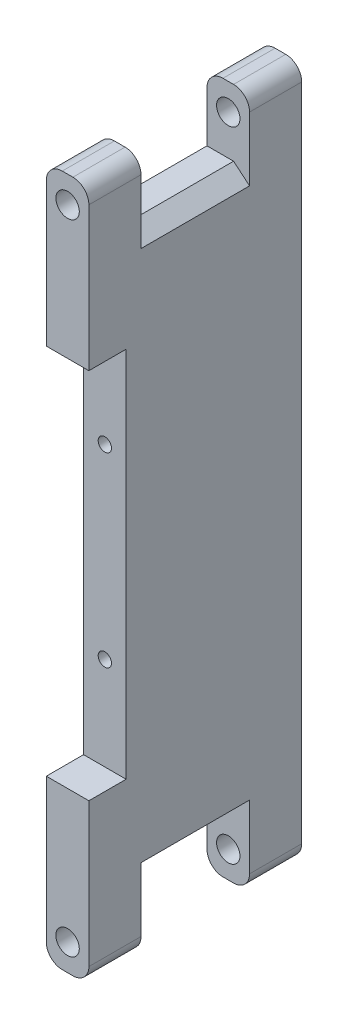
ISO-10303-21;
HEADER;
FILE_DESCRIPTION(('STEP AP214'),'2;1');
FILE_NAME('part.step','',(''),(''),'','','');
FILE_SCHEMA(('AUTOMOTIVE_DESIGN { 1 0 10303 214 1 1 1 1 }'));
ENDSEC;
DATA;
#1=APPLICATION_CONTEXT('core data for automotive mechanical design processes');
#2=APPLICATION_PROTOCOL_DEFINITION('international standard','automotive_design',2000,#1);
#3=PRODUCT_CONTEXT('',#1,'mechanical');
#4=PRODUCT('Part','Part','',(#3));
#5=PRODUCT_RELATED_PRODUCT_CATEGORY('part','',(#4));
#6=PRODUCT_DEFINITION_FORMATION('','',#4);
#7=PRODUCT_DEFINITION_CONTEXT('part definition',#1,'design');
#8=PRODUCT_DEFINITION('design','',#6,#7);
#9=PRODUCT_DEFINITION_SHAPE('','',#8);
#10=(LENGTH_UNIT() NAMED_UNIT(*) SI_UNIT(.MILLI.,.METRE.));
#11=(NAMED_UNIT(*) PLANE_ANGLE_UNIT() SI_UNIT($,.RADIAN.));
#12=(NAMED_UNIT(*) SI_UNIT($,.STERADIAN.) SOLID_ANGLE_UNIT());
#13=UNCERTAINTY_MEASURE_WITH_UNIT(LENGTH_MEASURE(1.E-05),#10,'distance_accuracy_value','');
#14=(GEOMETRIC_REPRESENTATION_CONTEXT(3) GLOBAL_UNCERTAINTY_ASSIGNED_CONTEXT((#13)) GLOBAL_UNIT_ASSIGNED_CONTEXT((#10,
#11,#12)) REPRESENTATION_CONTEXT('',''));
#15=CARTESIAN_POINT('',(0.,0.,0.));
#16=DIRECTION('',(0.,0.,1.));
#17=DIRECTION('',(1.,0.,0.));
#18=AXIS2_PLACEMENT_3D('',#15,#16,#17);
#19=CARTESIAN_POINT('',(0.,0.,0.));
#20=DIRECTION('',(0.,0.,1.));
#21=DIRECTION('',(1.,0.,0.));
#22=AXIS2_PLACEMENT_3D('',#19,#20,#21);
#23=PLANE('',#22);
#24=DIRECTION('',(1.,0.,0.));
#25=VECTOR('',#24,1.);
#26=CARTESIAN_POINT('',(0.,-35.,0.));
#27=LINE('',#26,#25);
#28=CARTESIAN_POINT('',(-4.00000000000001,-35.,0.));
#29=VERTEX_POINT('',#28);
#30=CARTESIAN_POINT('',(4.00000000000001,-35.,0.));
#31=VERTEX_POINT('',#30);
#32=EDGE_CURVE('E223',#29,#31,#27,.T.);
#33=ORIENTED_EDGE('',*,*,#32,.F.);
#34=DIRECTION('',(0.,-1.,0.));
#35=VECTOR('',#34,1.);
#36=CARTESIAN_POINT('',(-4.00000000000001,65.,0.));
#37=LINE('',#36,#35);
#38=CARTESIAN_POINT('',(-3.99999999999999,-62.,0.));
#39=VERTEX_POINT('',#38);
#40=EDGE_CURVE('E241',#29,#39,#37,.T.);
#41=ORIENTED_EDGE('',*,*,#40,.T.);
#42=CARTESIAN_POINT('',(-0.99999999999999,-62.,0.));
#43=DIRECTION('',(0.,0.,1.));
#44=DIRECTION('',(1.,0.,0.));
#45=AXIS2_PLACEMENT_3D('',#42,#43,#44);
#46=CIRCLE('',#45,3.);
#47=CARTESIAN_POINT('',(-0.99999999999999,-65.,0.));
#48=VERTEX_POINT('',#47);
#49=EDGE_CURVE('E302',#39,#48,#46,.T.);
#50=ORIENTED_EDGE('',*,*,#49,.T.);
#51=DIRECTION('',(1.,0.,0.));
#52=VECTOR('',#51,1.);
#53=CARTESIAN_POINT('',(-3.99999999999999,-65.,0.));
#54=LINE('',#53,#52);
#55=CARTESIAN_POINT('',(1.00000000000001,-65.,0.));
#56=VERTEX_POINT('',#55);
#57=EDGE_CURVE('E240',#48,#56,#54,.T.);
#58=ORIENTED_EDGE('',*,*,#57,.T.);
#59=CARTESIAN_POINT('',(1.00000000000001,-62.,0.));
#60=DIRECTION('',(0.,0.,1.));
#61=DIRECTION('',(1.,0.,0.));
#62=AXIS2_PLACEMENT_3D('',#59,#60,#61);
#63=CIRCLE('',#62,3.);
#64=CARTESIAN_POINT('',(4.00000000000001,-62.,0.));
#65=VERTEX_POINT('',#64);
#66=EDGE_CURVE('E300',#56,#65,#63,.T.);
#67=ORIENTED_EDGE('',*,*,#66,.T.);
#68=DIRECTION('',(0.,1.,0.));
#69=VECTOR('',#68,1.);
#70=CARTESIAN_POINT('',(3.99999999999999,65.,0.));
#71=LINE('',#70,#69);
#72=EDGE_CURVE('E412',#65,#31,#71,.T.);
#73=ORIENTED_EDGE('',*,*,#72,.T.);
#74=EDGE_LOOP('',(#33,#41,#50,#58,#67,#73));
#75=FACE_BOUND('',#74,.T.);
#76=CARTESIAN_POINT('',(0.,-60.,0.));
#77=DIRECTION('',(0.,0.,1.));
#78=DIRECTION('',(-1.,0.,0.));
#79=AXIS2_PLACEMENT_3D('',#76,#77,#78);
#80=CIRCLE('',#79,2.2);
#81=CARTESIAN_POINT('',(-2.2,-60.,0.));
#82=VERTEX_POINT('',#81);
#83=EDGE_CURVE('E448',#82,#82,#80,.T.);
#84=ORIENTED_EDGE('',*,*,#83,.F.);
#85=EDGE_LOOP('',(#84));
#86=FACE_BOUND('',#85,.T.);
#87=ADVANCED_FACE('F39',(#75,#86),#23,.T.);
#88=CARTESIAN_POINT('',(-3.99999999999999,-65.,-40.));
#89=DIRECTION('',(0.,-1.,0.));
#90=DIRECTION('',(0.,0.,-1.));
#91=AXIS2_PLACEMENT_3D('',#88,#89,#90);
#92=PLANE('',#91);
#93=ORIENTED_EDGE('',*,*,#57,.F.);
#94=DIRECTION('',(0.,0.,1.));
#95=VECTOR('',#94,1.);
#96=CARTESIAN_POINT('',(-0.99999999999999,-65.,-40.));
#97=LINE('',#96,#95);
#98=CARTESIAN_POINT('',(-0.99999999999999,-65.,-9.8));
#99=VERTEX_POINT('',#98);
#100=EDGE_CURVE('E307',#48,#99,#97,.F.);
#101=ORIENTED_EDGE('',*,*,#100,.T.);
#102=DIRECTION('',(-1.,0.,0.));
#103=VECTOR('',#102,1.);
#104=CARTESIAN_POINT('',(-3.99999999999999,-65.,-9.8));
#105=LINE('',#104,#103);
#106=CARTESIAN_POINT('',(1.00000000000001,-65.,-9.8));
#107=VERTEX_POINT('',#106);
#108=EDGE_CURVE('E400',#107,#99,#105,.T.);
#109=ORIENTED_EDGE('',*,*,#108,.F.);
#110=DIRECTION('',(0.,0.,1.));
#111=VECTOR('',#110,1.);
#112=CARTESIAN_POINT('',(1.00000000000001,-65.,-40.));
#113=LINE('',#112,#111);
#114=EDGE_CURVE('E304',#107,#56,#113,.T.);
#115=ORIENTED_EDGE('',*,*,#114,.T.);
#116=EDGE_LOOP('',(#93,#101,#109,#115));
#117=FACE_BOUND('',#116,.T.);
#118=ADVANCED_FACE('F513',(#117),#92,.T.);
#119=CARTESIAN_POINT('',(-4.00000000000001,65.,-40.));
#120=DIRECTION('',(0.,1.,0.));
#121=DIRECTION('',(0.,0.,1.));
#122=AXIS2_PLACEMENT_3D('',#119,#120,#121);
#123=PLANE('',#122);
#124=DIRECTION('',(-1.,0.,0.));
#125=VECTOR('',#124,1.);
#126=CARTESIAN_POINT('',(-4.00000000000001,65.,-40.));
#127=LINE('',#126,#125);
#128=CARTESIAN_POINT('',(0.999999999999995,65.,-40.));
#129=VERTEX_POINT('',#128);
#130=CARTESIAN_POINT('',(-1.00000000000001,65.,-40.));
#131=VERTEX_POINT('',#130);
#132=EDGE_CURVE('E405',#129,#131,#127,.T.);
#133=ORIENTED_EDGE('',*,*,#132,.T.);
#134=DIRECTION('',(0.,0.,1.));
#135=VECTOR('',#134,1.);
#136=CARTESIAN_POINT('',(-1.00000000000001,65.,-40.));
#137=LINE('',#136,#135);
#138=CARTESIAN_POINT('',(-1.00000000000001,65.,-30.2));
#139=VERTEX_POINT('',#138);
#140=EDGE_CURVE('E324',#131,#139,#137,.T.);
#141=ORIENTED_EDGE('',*,*,#140,.T.);
#142=DIRECTION('',(-1.,0.,0.));
#143=VECTOR('',#142,1.);
#144=CARTESIAN_POINT('',(-4.00000000000001,65.,-30.2));
#145=LINE('',#144,#143);
#146=CARTESIAN_POINT('',(0.999999999999995,65.,-30.2));
#147=VERTEX_POINT('',#146);
#148=EDGE_CURVE('E253',#147,#139,#145,.T.);
#149=ORIENTED_EDGE('',*,*,#148,.F.);
#150=DIRECTION('',(0.,0.,1.));
#151=VECTOR('',#150,1.);
#152=CARTESIAN_POINT('',(0.999999999999995,65.,-40.));
#153=LINE('',#152,#151);
#154=EDGE_CURVE('E322',#147,#129,#153,.F.);
#155=ORIENTED_EDGE('',*,*,#154,.T.);
#156=EDGE_LOOP('',(#133,#141,#149,#155));
#157=FACE_BOUND('',#156,.T.);
#158=ADVANCED_FACE('F554',(#157),#123,.T.);
#159=CARTESIAN_POINT('',(3.99999999999999,65.,-40.));
#160=DIRECTION('',(1.,0.,0.));
#161=DIRECTION('',(0.,1.,0.));
#162=AXIS2_PLACEMENT_3D('',#159,#160,#161);
#163=PLANE('',#162);
#164=DIRECTION('',(0.,-1.,0.));
#165=VECTOR('',#164,1.);
#166=CARTESIAN_POINT('',(4.00000000000001,-77.5,-9.8));
#167=LINE('',#166,#165);
#168=CARTESIAN_POINT('',(4.00000000000001,-49.9827011064681,-9.8));
#169=VERTEX_POINT('',#168);
#170=CARTESIAN_POINT('',(4.00000000000001,-62.,-9.8));
#171=VERTEX_POINT('',#170);
#172=EDGE_CURVE('E370',#169,#171,#167,.T.);
#173=ORIENTED_EDGE('',*,*,#172,.F.);
#174=DIRECTION('',(0.,0.,-1.));
#175=VECTOR('',#174,1.);
#176=CARTESIAN_POINT('',(4.00000000000001,-49.9827011064681,-30.2));
#177=LINE('',#176,#175);
#178=CARTESIAN_POINT('',(4.00000000000001,-49.9827011064681,-30.2));
#179=VERTEX_POINT('',#178);
#180=EDGE_CURVE('E347',#169,#179,#177,.T.);
#181=ORIENTED_EDGE('',*,*,#180,.T.);
#182=DIRECTION('',(0.,1.,0.));
#183=VECTOR('',#182,1.);
#184=CARTESIAN_POINT('',(4.00000000000001,-77.5,-30.2));
#185=LINE('',#184,#183);
#186=CARTESIAN_POINT('',(4.00000000000001,-62.,-30.2));
#187=VERTEX_POINT('',#186);
#188=EDGE_CURVE('E375',#187,#179,#185,.T.);
#189=ORIENTED_EDGE('',*,*,#188,.F.);
#190=DIRECTION('',(0.,0.,1.));
#191=VECTOR('',#190,1.);
#192=CARTESIAN_POINT('',(4.00000000000001,-62.,-40.));
#193=LINE('',#192,#191);
#194=CARTESIAN_POINT('',(4.00000000000001,-62.,-40.));
#195=VERTEX_POINT('',#194);
#196=EDGE_CURVE('E295',#187,#195,#193,.F.);
#197=ORIENTED_EDGE('',*,*,#196,.T.);
#198=DIRECTION('',(0.,1.,0.));
#199=VECTOR('',#198,1.);
#200=CARTESIAN_POINT('',(3.99999999999999,65.,-40.));
#201=LINE('',#200,#199);
#202=CARTESIAN_POINT('',(3.99999999999999,62.,-40.));
#203=VERTEX_POINT('',#202);
#204=EDGE_CURVE('E244',#195,#203,#201,.T.);
#205=ORIENTED_EDGE('',*,*,#204,.T.);
#206=DIRECTION('',(0.,0.,1.));
#207=VECTOR('',#206,1.);
#208=CARTESIAN_POINT('',(3.99999999999999,62.,-40.));
#209=LINE('',#208,#207);
#210=CARTESIAN_POINT('',(3.99999999999999,62.,-30.2));
#211=VERTEX_POINT('',#210);
#212=EDGE_CURVE('E290',#203,#211,#209,.T.);
#213=ORIENTED_EDGE('',*,*,#212,.T.);
#214=DIRECTION('',(0.,1.,0.));
#215=VECTOR('',#214,1.);
#216=CARTESIAN_POINT('',(3.99999999999999,77.5,-30.2));
#217=LINE('',#216,#215);
#218=CARTESIAN_POINT('',(4.,49.9827011064681,-30.2));
#219=VERTEX_POINT('',#218);
#220=EDGE_CURVE('E360',#219,#211,#217,.T.);
#221=ORIENTED_EDGE('',*,*,#220,.F.);
#222=DIRECTION('',(0.,0.,1.));
#223=VECTOR('',#222,1.);
#224=CARTESIAN_POINT('',(4.,49.9827011064681,-9.8));
#225=LINE('',#224,#223);
#226=CARTESIAN_POINT('',(4.,49.9827011064681,-9.8));
#227=VERTEX_POINT('',#226);
#228=EDGE_CURVE('E344',#219,#227,#225,.T.);
#229=ORIENTED_EDGE('',*,*,#228,.T.);
#230=DIRECTION('',(0.,-1.,0.));
#231=VECTOR('',#230,1.);
#232=CARTESIAN_POINT('',(3.99999999999999,77.5,-9.8));
#233=LINE('',#232,#231);
#234=CARTESIAN_POINT('',(3.99999999999999,62.,-9.8));
#235=VERTEX_POINT('',#234);
#236=EDGE_CURVE('E366',#235,#227,#233,.T.);
#237=ORIENTED_EDGE('',*,*,#236,.F.);
#238=DIRECTION('',(0.,0.,1.));
#239=VECTOR('',#238,1.);
#240=CARTESIAN_POINT('',(3.99999999999999,62.,-40.));
#241=LINE('',#240,#239);
#242=CARTESIAN_POINT('',(3.99999999999999,62.,0.));
#243=VERTEX_POINT('',#242);
#244=EDGE_CURVE('E287',#235,#243,#241,.T.);
#245=ORIENTED_EDGE('',*,*,#244,.T.);
#246=CARTESIAN_POINT('',(4.,35.,0.));
#247=VERTEX_POINT('',#246);
#248=EDGE_CURVE('E403',#247,#243,#71,.T.);
#249=ORIENTED_EDGE('',*,*,#248,.F.);
#250=DIRECTION('',(0.,0.,1.));
#251=VECTOR('',#250,1.);
#252=CARTESIAN_POINT('',(4.,35.,-40.));
#253=LINE('',#252,#251);
#254=CARTESIAN_POINT('',(4.,35.,-7.));
#255=VERTEX_POINT('',#254);
#256=EDGE_CURVE('E219',#255,#247,#253,.T.);
#257=ORIENTED_EDGE('',*,*,#256,.F.);
#258=DIRECTION('',(0.,-1.,0.));
#259=VECTOR('',#258,1.);
#260=CARTESIAN_POINT('',(3.99999999999999,65.,-7.));
#261=LINE('',#260,#259);
#262=CARTESIAN_POINT('',(4.,-35.,-7.));
#263=VERTEX_POINT('',#262);
#264=EDGE_CURVE('E449',#255,#263,#261,.T.);
#265=ORIENTED_EDGE('',*,*,#264,.T.);
#266=DIRECTION('',(0.,0.,-1.));
#267=VECTOR('',#266,1.);
#268=CARTESIAN_POINT('',(4.00000000000001,-35.,-40.));
#269=LINE('',#268,#267);
#270=EDGE_CURVE('E459',#31,#263,#269,.T.);
#271=ORIENTED_EDGE('',*,*,#270,.F.);
#272=ORIENTED_EDGE('',*,*,#72,.F.);
#273=DIRECTION('',(0.,0.,1.));
#274=VECTOR('',#273,1.);
#275=CARTESIAN_POINT('',(4.00000000000001,-62.,-40.));
#276=LINE('',#275,#274);
#277=EDGE_CURVE('E293',#65,#171,#276,.F.);
#278=ORIENTED_EDGE('',*,*,#277,.T.);
#279=EDGE_LOOP('',(#173,#181,#189,#197,#205,#213,#221,#229,#237,#245,#249,#257,#265,#271,#272,#278));
#280=FACE_BOUND('',#279,.T.);
#281=ADVANCED_FACE('F365',(#280),#163,.T.);
#282=DIRECTION('',(1.,0.,0.));
#283=VECTOR('',#282,1.);
#284=CARTESIAN_POINT('',(-3.99999999999999,-65.,-30.2));
#285=LINE('',#284,#283);
#286=CARTESIAN_POINT('',(-0.99999999999999,-65.,-30.2));
#287=VERTEX_POINT('',#286);
#288=CARTESIAN_POINT('',(1.00000000000001,-65.,-30.2));
#289=VERTEX_POINT('',#288);
#290=EDGE_CURVE('E382',#287,#289,#285,.T.);
#291=ORIENTED_EDGE('',*,*,#290,.F.);
#292=DIRECTION('',(0.,0.,1.));
#293=VECTOR('',#292,1.);
#294=CARTESIAN_POINT('',(-0.99999999999999,-65.,-40.));
#295=LINE('',#294,#293);
#296=CARTESIAN_POINT('',(-0.99999999999999,-65.,-40.));
#297=VERTEX_POINT('',#296);
#298=EDGE_CURVE('E277',#287,#297,#295,.F.);
#299=ORIENTED_EDGE('',*,*,#298,.T.);
#300=DIRECTION('',(1.,0.,0.));
#301=VECTOR('',#300,1.);
#302=CARTESIAN_POINT('',(-3.99999999999999,-65.,-40.));
#303=LINE('',#302,#301);
#304=CARTESIAN_POINT('',(1.00000000000001,-65.,-40.));
#305=VERTEX_POINT('',#304);
#306=EDGE_CURVE('E254',#297,#305,#303,.T.);
#307=ORIENTED_EDGE('',*,*,#306,.T.);
#308=DIRECTION('',(0.,0.,1.));
#309=VECTOR('',#308,1.);
#310=CARTESIAN_POINT('',(1.00000000000001,-65.,-40.));
#311=LINE('',#310,#309);
#312=EDGE_CURVE('E274',#305,#289,#311,.T.);
#313=ORIENTED_EDGE('',*,*,#312,.T.);
#314=EDGE_LOOP('',(#291,#299,#307,#313));
#315=FACE_BOUND('',#314,.T.);
#316=ADVANCED_FACE('F540',(#315),#92,.T.);
#317=CARTESIAN_POINT('',(-4.00000000000001,65.,-40.));
#318=DIRECTION('',(-1.,0.,0.));
#319=DIRECTION('',(0.,-1.,0.));
#320=AXIS2_PLACEMENT_3D('',#317,#318,#319);
#321=PLANE('',#320);
#322=DIRECTION('',(0.,0.,1.));
#323=VECTOR('',#322,1.);
#324=CARTESIAN_POINT('',(-3.99999999999999,-35.,-40.));
#325=LINE('',#324,#323);
#326=CARTESIAN_POINT('',(-4.,-35.,-7.));
#327=VERTEX_POINT('',#326);
#328=EDGE_CURVE('E461',#327,#29,#325,.T.);
#329=ORIENTED_EDGE('',*,*,#328,.F.);
#330=DIRECTION('',(0.,1.,0.));
#331=VECTOR('',#330,1.);
#332=CARTESIAN_POINT('',(-4.00000000000001,65.,-7.));
#333=LINE('',#332,#331);
#334=CARTESIAN_POINT('',(-4.,35.,-7.));
#335=VERTEX_POINT('',#334);
#336=EDGE_CURVE('E233',#327,#335,#333,.T.);
#337=ORIENTED_EDGE('',*,*,#336,.T.);
#338=DIRECTION('',(0.,0.,-1.));
#339=VECTOR('',#338,1.);
#340=CARTESIAN_POINT('',(-4.,35.,-40.));
#341=LINE('',#340,#339);
#342=CARTESIAN_POINT('',(-4.00000000000001,35.,0.));
#343=VERTEX_POINT('',#342);
#344=EDGE_CURVE('E216',#343,#335,#341,.T.);
#345=ORIENTED_EDGE('',*,*,#344,.F.);
#346=CARTESIAN_POINT('',(-4.00000000000001,62.,0.));
#347=VERTEX_POINT('',#346);
#348=EDGE_CURVE('E231',#347,#343,#37,.T.);
#349=ORIENTED_EDGE('',*,*,#348,.F.);
#350=DIRECTION('',(0.,0.,1.));
#351=VECTOR('',#350,1.);
#352=CARTESIAN_POINT('',(-4.00000000000001,62.,-40.));
#353=LINE('',#352,#351);
#354=CARTESIAN_POINT('',(-4.00000000000002,62.,-9.8));
#355=VERTEX_POINT('',#354);
#356=EDGE_CURVE('E262',#347,#355,#353,.F.);
#357=ORIENTED_EDGE('',*,*,#356,.T.);
#358=DIRECTION('',(0.,-1.,0.));
#359=VECTOR('',#358,1.);
#360=CARTESIAN_POINT('',(-4.00000000000002,77.5,-9.8));
#361=LINE('',#360,#359);
#362=CARTESIAN_POINT('',(-4.00000000000002,52.5,-9.8));
#363=VERTEX_POINT('',#362);
#364=EDGE_CURVE('E430',#355,#363,#361,.T.);
#365=ORIENTED_EDGE('',*,*,#364,.T.);
#366=DIRECTION('',(0.,0.,-1.));
#367=VECTOR('',#366,1.);
#368=CARTESIAN_POINT('',(-4.00000000000002,52.5,-9.8));
#369=LINE('',#368,#367);
#370=CARTESIAN_POINT('',(-4.00000000000002,52.5,-30.2));
#371=VERTEX_POINT('',#370);
#372=EDGE_CURVE('E378',#363,#371,#369,.T.);
#373=ORIENTED_EDGE('',*,*,#372,.T.);
#374=DIRECTION('',(0.,1.,0.));
#375=VECTOR('',#374,1.);
#376=CARTESIAN_POINT('',(-4.00000000000002,77.5,-30.2));
#377=LINE('',#376,#375);
#378=CARTESIAN_POINT('',(-4.00000000000002,62.,-30.2));
#379=VERTEX_POINT('',#378);
#380=EDGE_CURVE('E372',#371,#379,#377,.T.);
#381=ORIENTED_EDGE('',*,*,#380,.T.);
#382=DIRECTION('',(0.,0.,1.));
#383=VECTOR('',#382,1.);
#384=CARTESIAN_POINT('',(-4.00000000000001,62.,-40.));
#385=LINE('',#384,#383);
#386=CARTESIAN_POINT('',(-4.00000000000001,62.,-40.));
#387=VERTEX_POINT('',#386);
#388=EDGE_CURVE('E260',#379,#387,#385,.F.);
#389=ORIENTED_EDGE('',*,*,#388,.T.);
#390=DIRECTION('',(0.,-1.,0.));
#391=VECTOR('',#390,1.);
#392=CARTESIAN_POINT('',(-4.00000000000001,65.,-40.));
#393=LINE('',#392,#391);
#394=CARTESIAN_POINT('',(-3.99999999999999,-62.,-40.));
#395=VERTEX_POINT('',#394);
#396=EDGE_CURVE('E408',#387,#395,#393,.T.);
#397=ORIENTED_EDGE('',*,*,#396,.T.);
#398=DIRECTION('',(0.,0.,1.));
#399=VECTOR('',#398,1.);
#400=CARTESIAN_POINT('',(-3.99999999999999,-62.,-40.));
#401=LINE('',#400,#399);
#402=CARTESIAN_POINT('',(-3.99999999999999,-62.,-30.2));
#403=VERTEX_POINT('',#402);
#404=EDGE_CURVE('E267',#395,#403,#401,.T.);
#405=ORIENTED_EDGE('',*,*,#404,.T.);
#406=DIRECTION('',(0.,-1.,0.));
#407=VECTOR('',#406,1.);
#408=CARTESIAN_POINT('',(-4.00000000000001,65.,-30.2));
#409=LINE('',#408,#407);
#410=CARTESIAN_POINT('',(-3.99999999999999,-52.5,-30.2));
#411=VERTEX_POINT('',#410);
#412=EDGE_CURVE('E257',#411,#403,#409,.T.);
#413=ORIENTED_EDGE('',*,*,#412,.F.);
#414=DIRECTION('',(0.,0.,1.));
#415=VECTOR('',#414,1.);
#416=CARTESIAN_POINT('',(-4.00000000000001,-52.5,-9.8));
#417=LINE('',#416,#415);
#418=CARTESIAN_POINT('',(-4.00000000000001,-52.5,-9.8));
#419=VERTEX_POINT('',#418);
#420=EDGE_CURVE('E388',#411,#419,#417,.T.);
#421=ORIENTED_EDGE('',*,*,#420,.T.);
#422=DIRECTION('',(0.,-1.,0.));
#423=VECTOR('',#422,1.);
#424=CARTESIAN_POINT('',(-4.,-77.5,-9.8));
#425=LINE('',#424,#423);
#426=CARTESIAN_POINT('',(-4.00000000000001,-62.,-9.8));
#427=VERTEX_POINT('',#426);
#428=EDGE_CURVE('E392',#419,#427,#425,.T.);
#429=ORIENTED_EDGE('',*,*,#428,.T.);
#430=DIRECTION('',(0.,0.,1.));
#431=VECTOR('',#430,1.);
#432=CARTESIAN_POINT('',(-3.99999999999999,-62.,-40.));
#433=LINE('',#432,#431);
#434=EDGE_CURVE('E264',#427,#39,#433,.T.);
#435=ORIENTED_EDGE('',*,*,#434,.T.);
#436=ORIENTED_EDGE('',*,*,#40,.F.);
#437=EDGE_LOOP('',(#329,#337,#345,#349,#357,#365,#373,#381,#389,#397,#405,#413,#421,#429,#435,#436));
#438=FACE_BOUND('',#437,.T.);
#439=ADVANCED_FACE('F230',(#438),#321,.T.);
#440=DIRECTION('',(1.,0.,0.));
#441=VECTOR('',#440,1.);
#442=CARTESIAN_POINT('',(-4.00000000000001,65.,-9.8));
#443=LINE('',#442,#441);
#444=CARTESIAN_POINT('',(-1.00000000000001,65.,-9.8));
#445=VERTEX_POINT('',#444);
#446=CARTESIAN_POINT('',(0.999999999999995,65.,-9.8));
#447=VERTEX_POINT('',#446);
#448=EDGE_CURVE('E250',#445,#447,#443,.T.);
#449=ORIENTED_EDGE('',*,*,#448,.F.);
#450=DIRECTION('',(0.,0.,1.));
#451=VECTOR('',#450,1.);
#452=CARTESIAN_POINT('',(-1.00000000000001,65.,-40.));
#453=LINE('',#452,#451);
#454=CARTESIAN_POINT('',(-1.00000000000001,65.,0.));
#455=VERTEX_POINT('',#454);
#456=EDGE_CURVE('E315',#445,#455,#453,.T.);
#457=ORIENTED_EDGE('',*,*,#456,.T.);
#458=DIRECTION('',(-1.,0.,0.));
#459=VECTOR('',#458,1.);
#460=CARTESIAN_POINT('',(-4.00000000000001,65.,0.));
#461=LINE('',#460,#459);
#462=CARTESIAN_POINT('',(0.999999999999995,65.,0.));
#463=VERTEX_POINT('',#462);
#464=EDGE_CURVE('E246',#463,#455,#461,.T.);
#465=ORIENTED_EDGE('',*,*,#464,.F.);
#466=DIRECTION('',(0.,0.,1.));
#467=VECTOR('',#466,1.);
#468=CARTESIAN_POINT('',(0.999999999999995,65.,-40.));
#469=LINE('',#468,#467);
#470=EDGE_CURVE('E313',#463,#447,#469,.F.);
#471=ORIENTED_EDGE('',*,*,#470,.T.);
#472=EDGE_LOOP('',(#449,#457,#465,#471));
#473=FACE_BOUND('',#472,.T.);
#474=ADVANCED_FACE('F425',(#473),#123,.T.);
#475=CARTESIAN_POINT('',(0.,0.,-40.));
#476=DIRECTION('',(0.,0.,1.));
#477=DIRECTION('',(1.,0.,0.));
#478=AXIS2_PLACEMENT_3D('',#475,#476,#477);
#479=PLANE('',#478);
#480=CARTESIAN_POINT('',(0.,60.,-40.));
#481=DIRECTION('',(0.,0.,1.));
#482=DIRECTION('',(1.,0.,0.));
#483=AXIS2_PLACEMENT_3D('',#480,#481,#482);
#484=CIRCLE('',#483,2.2);
#485=CARTESIAN_POINT('',(2.2,60.,-40.));
#486=VERTEX_POINT('',#485);
#487=EDGE_CURVE('E334',#486,#486,#484,.T.);
#488=ORIENTED_EDGE('',*,*,#487,.T.);
#489=EDGE_LOOP('',(#488));
#490=FACE_BOUND('',#489,.T.);
#491=CARTESIAN_POINT('',(0.,-60.,-40.));
#492=DIRECTION('',(0.,0.,1.));
#493=DIRECTION('',(-1.,0.,0.));
#494=AXIS2_PLACEMENT_3D('',#491,#492,#493);
#495=CIRCLE('',#494,2.2);
#496=CARTESIAN_POINT('',(-2.2,-60.,-40.));
#497=VERTEX_POINT('',#496);
#498=EDGE_CURVE('E445',#497,#497,#495,.T.);
#499=ORIENTED_EDGE('',*,*,#498,.T.);
#500=EDGE_LOOP('',(#499));
#501=FACE_BOUND('',#500,.T.);
#502=ORIENTED_EDGE('',*,*,#306,.F.);
#503=CARTESIAN_POINT('',(-0.99999999999999,-62.,-40.));
#504=DIRECTION('',(0.,0.,1.));
#505=DIRECTION('',(1.,0.,0.));
#506=AXIS2_PLACEMENT_3D('',#503,#504,#505);
#507=CIRCLE('',#506,3.);
#508=EDGE_CURVE('E285',#297,#395,#507,.F.);
#509=ORIENTED_EDGE('',*,*,#508,.T.);
#510=ORIENTED_EDGE('',*,*,#396,.F.);
#511=CARTESIAN_POINT('',(-1.00000000000001,62.,-40.));
#512=DIRECTION('',(0.,0.,1.));
#513=DIRECTION('',(1.,0.,0.));
#514=AXIS2_PLACEMENT_3D('',#511,#512,#513);
#515=CIRCLE('',#514,3.);
#516=EDGE_CURVE('E281',#387,#131,#515,.F.);
#517=ORIENTED_EDGE('',*,*,#516,.T.);
#518=ORIENTED_EDGE('',*,*,#132,.F.);
#519=CARTESIAN_POINT('',(0.999999999999994,62.,-40.));
#520=DIRECTION('',(0.,0.,1.));
#521=DIRECTION('',(1.,0.,0.));
#522=AXIS2_PLACEMENT_3D('',#519,#520,#521);
#523=CIRCLE('',#522,3.);
#524=EDGE_CURVE('E279',#129,#203,#523,.F.);
#525=ORIENTED_EDGE('',*,*,#524,.T.);
#526=ORIENTED_EDGE('',*,*,#204,.F.);
#527=CARTESIAN_POINT('',(1.00000000000001,-62.,-40.));
#528=DIRECTION('',(0.,0.,1.));
#529=DIRECTION('',(1.,0.,0.));
#530=AXIS2_PLACEMENT_3D('',#527,#528,#529);
#531=CIRCLE('',#530,3.);
#532=EDGE_CURVE('E283',#195,#305,#531,.F.);
#533=ORIENTED_EDGE('',*,*,#532,.T.);
#534=EDGE_LOOP('',(#502,#509,#510,#517,#518,#525,#526,#533));
#535=FACE_BOUND('',#534,.T.);
#536=ADVANCED_FACE('F536',(#490,#501,#535),#479,.F.);
#537=DIRECTION('',(-1.,0.,0.));
#538=VECTOR('',#537,1.);
#539=CARTESIAN_POINT('',(0.,35.,0.));
#540=LINE('',#539,#538);
#541=EDGE_CURVE('E212',#247,#343,#540,.T.);
#542=ORIENTED_EDGE('',*,*,#541,.F.);
#543=ORIENTED_EDGE('',*,*,#248,.T.);
#544=CARTESIAN_POINT('',(0.999999999999994,62.,0.));
#545=DIRECTION('',(0.,0.,1.));
#546=DIRECTION('',(1.,0.,0.));
#547=AXIS2_PLACEMENT_3D('',#544,#545,#546);
#548=CIRCLE('',#547,3.);
#549=EDGE_CURVE('E297',#243,#463,#548,.T.);
#550=ORIENTED_EDGE('',*,*,#549,.T.);
#551=ORIENTED_EDGE('',*,*,#464,.T.);
#552=CARTESIAN_POINT('',(-1.00000000000001,62.,0.));
#553=DIRECTION('',(0.,0.,1.));
#554=DIRECTION('',(1.,0.,0.));
#555=AXIS2_PLACEMENT_3D('',#552,#553,#554);
#556=CIRCLE('',#555,3.);
#557=EDGE_CURVE('E239',#455,#347,#556,.T.);
#558=ORIENTED_EDGE('',*,*,#557,.T.);
#559=ORIENTED_EDGE('',*,*,#348,.T.);
#560=EDGE_LOOP('',(#542,#543,#550,#551,#558,#559));
#561=FACE_BOUND('',#560,.T.);
#562=CARTESIAN_POINT('',(0.,60.,0.));
#563=DIRECTION('',(0.,0.,1.));
#564=DIRECTION('',(1.,0.,0.));
#565=AXIS2_PLACEMENT_3D('',#562,#563,#564);
#566=CIRCLE('',#565,2.2);
#567=CARTESIAN_POINT('',(2.2,60.,0.));
#568=VERTEX_POINT('',#567);
#569=EDGE_CURVE('E452',#568,#568,#566,.T.);
#570=ORIENTED_EDGE('',*,*,#569,.F.);
#571=EDGE_LOOP('',(#570));
#572=FACE_BOUND('',#571,.T.);
#573=ADVANCED_FACE('F236',(#561,#572),#23,.T.);
#574=CARTESIAN_POINT('',(-4.00000000000002,77.5,-30.2));
#575=DIRECTION('',(0.,0.,-1.));
#576=DIRECTION('',(-1.,0.,0.));
#577=AXIS2_PLACEMENT_3D('',#574,#575,#576);
#578=PLANE('',#577);
#579=CARTESIAN_POINT('',(0.,60.,-30.2));
#580=DIRECTION('',(0.,0.,-1.));
#581=DIRECTION('',(-1.,0.,0.));
#582=AXIS2_PLACEMENT_3D('',#579,#580,#581);
#583=CIRCLE('',#582,2.2);
#584=CARTESIAN_POINT('',(-2.2,60.,-30.2));
#585=VERTEX_POINT('',#584);
#586=EDGE_CURVE('E337',#585,#585,#583,.T.);
#587=ORIENTED_EDGE('',*,*,#586,.T.);
#588=EDGE_LOOP('',(#587));
#589=FACE_BOUND('',#588,.T.);
#590=ORIENTED_EDGE('',*,*,#148,.T.);
#591=CARTESIAN_POINT('',(-1.00000000000001,62.,-30.2));
#592=DIRECTION('',(0.,0.,-1.));
#593=DIRECTION('',(-1.,0.,0.));
#594=AXIS2_PLACEMENT_3D('',#591,#592,#593);
#595=CIRCLE('',#594,3.);
#596=EDGE_CURVE('E224',#139,#379,#595,.F.);
#597=ORIENTED_EDGE('',*,*,#596,.T.);
#598=ORIENTED_EDGE('',*,*,#380,.F.);
#599=DIRECTION('',(1.,0.,0.));
#600=VECTOR('',#599,1.);
#601=CARTESIAN_POINT('',(-4.00000000000002,52.5,-30.2));
#602=LINE('',#601,#600);
#603=CARTESIAN_POINT('',(0.999999999999992,52.5,-30.2));
#604=VERTEX_POINT('',#603);
#605=EDGE_CURVE('E362',#371,#604,#602,.T.);
#606=ORIENTED_EDGE('',*,*,#605,.T.);
#607=DIRECTION('',(0.766044443118979,-0.642787609686538,0.));
#608=VECTOR('',#607,1.);
#609=CARTESIAN_POINT('',(-14.2442173568199,65.2914171616938,-30.2));
#610=LINE('',#609,#608);
#611=EDGE_CURVE('E48',#604,#219,#610,.T.);
#612=ORIENTED_EDGE('',*,*,#611,.T.);
#613=ORIENTED_EDGE('',*,*,#220,.T.);
#614=CARTESIAN_POINT('',(0.999999999999994,62.,-30.2));
#615=DIRECTION('',(0.,0.,-1.));
#616=DIRECTION('',(-1.,0.,0.));
#617=AXIS2_PLACEMENT_3D('',#614,#615,#616);
#618=CIRCLE('',#617,3.);
#619=EDGE_CURVE('E327',#211,#147,#618,.F.);
#620=ORIENTED_EDGE('',*,*,#619,.T.);
#621=EDGE_LOOP('',(#590,#597,#598,#606,#612,#613,#620));
#622=FACE_BOUND('',#621,.T.);
#623=ADVANCED_FACE('F359',(#589,#622),#578,.F.);
#624=CARTESIAN_POINT('',(-4.00000000000002,52.5,-9.8));
#625=DIRECTION('',(0.,-1.,0.));
#626=DIRECTION('',(1.,0.,0.));
#627=AXIS2_PLACEMENT_3D('',#624,#625,#626);
#628=PLANE('',#627);
#629=DIRECTION('',(1.,0.,0.));
#630=VECTOR('',#629,1.);
#631=CARTESIAN_POINT('',(-4.00000000000002,52.5,-9.8));
#632=LINE('',#631,#630);
#633=CARTESIAN_POINT('',(0.999999999999992,52.5,-9.8));
#634=VERTEX_POINT('',#633);
#635=EDGE_CURVE('E383',#363,#634,#632,.T.);
#636=ORIENTED_EDGE('',*,*,#635,.T.);
#637=DIRECTION('',(0.,0.,-1.));
#638=VECTOR('',#637,1.);
#639=CARTESIAN_POINT('',(0.999999999999992,52.5,-30.2));
#640=LINE('',#639,#638);
#641=EDGE_CURVE('E350',#634,#604,#640,.T.);
#642=ORIENTED_EDGE('',*,*,#641,.T.);
#643=ORIENTED_EDGE('',*,*,#605,.F.);
#644=ORIENTED_EDGE('',*,*,#372,.F.);
#645=EDGE_LOOP('',(#636,#642,#643,#644));
#646=FACE_BOUND('',#645,.T.);
#647=ADVANCED_FACE('F437',(#646),#628,.F.);
#648=CARTESIAN_POINT('',(-4.00000000000002,77.5,-9.8));
#649=DIRECTION('',(0.,0.,1.));
#650=DIRECTION('',(1.,0.,0.));
#651=AXIS2_PLACEMENT_3D('',#648,#649,#650);
#652=PLANE('',#651);
#653=CARTESIAN_POINT('',(0.,60.,-9.8));
#654=DIRECTION('',(0.,0.,1.));
#655=DIRECTION('',(1.,0.,0.));
#656=AXIS2_PLACEMENT_3D('',#653,#654,#655);
#657=CIRCLE('',#656,2.2);
#658=CARTESIAN_POINT('',(2.2,60.,-9.8));
#659=VERTEX_POINT('',#658);
#660=EDGE_CURVE('E335',#659,#659,#657,.T.);
#661=ORIENTED_EDGE('',*,*,#660,.T.);
#662=EDGE_LOOP('',(#661));
#663=FACE_BOUND('',#662,.T.);
#664=ORIENTED_EDGE('',*,*,#364,.F.);
#665=CARTESIAN_POINT('',(-1.00000000000001,62.,-9.8));
#666=DIRECTION('',(0.,0.,1.));
#667=DIRECTION('',(1.,0.,0.));
#668=AXIS2_PLACEMENT_3D('',#665,#666,#667);
#669=CIRCLE('',#668,3.);
#670=EDGE_CURVE('E320',#355,#445,#669,.F.);
#671=ORIENTED_EDGE('',*,*,#670,.T.);
#672=ORIENTED_EDGE('',*,*,#448,.T.);
#673=CARTESIAN_POINT('',(0.999999999999994,62.,-9.8));
#674=DIRECTION('',(0.,0.,1.));
#675=DIRECTION('',(1.,0.,0.));
#676=AXIS2_PLACEMENT_3D('',#673,#674,#675);
#677=CIRCLE('',#676,3.);
#678=EDGE_CURVE('E318',#447,#235,#677,.F.);
#679=ORIENTED_EDGE('',*,*,#678,.T.);
#680=ORIENTED_EDGE('',*,*,#236,.T.);
#681=DIRECTION('',(-0.766044443118979,0.642787609686538,0.));
#682=VECTOR('',#681,1.);
#683=CARTESIAN_POINT('',(-14.2442173568199,65.2914171616938,-9.8));
#684=LINE('',#683,#682);
#685=EDGE_CURVE('E11',#227,#634,#684,.T.);
#686=ORIENTED_EDGE('',*,*,#685,.T.);
#687=ORIENTED_EDGE('',*,*,#635,.F.);
#688=EDGE_LOOP('',(#664,#671,#672,#679,#680,#686,#687));
#689=FACE_BOUND('',#688,.T.);
#690=ADVANCED_FACE('F428',(#663,#689),#652,.F.);
#691=CARTESIAN_POINT('',(-4.,-77.5,-9.8));
#692=DIRECTION('',(0.,0.,1.));
#693=DIRECTION('',(1.,0.,0.));
#694=AXIS2_PLACEMENT_3D('',#691,#692,#693);
#695=PLANE('',#694);
#696=CARTESIAN_POINT('',(0.,-60.,-9.8));
#697=DIRECTION('',(0.,0.,1.));
#698=DIRECTION('',(1.,0.,0.));
#699=AXIS2_PLACEMENT_3D('',#696,#697,#698);
#700=CIRCLE('',#699,2.2);
#701=CARTESIAN_POINT('',(2.2,-60.,-9.8));
#702=VERTEX_POINT('',#701);
#703=EDGE_CURVE('E333',#702,#702,#700,.T.);
#704=ORIENTED_EDGE('',*,*,#703,.T.);
#705=EDGE_LOOP('',(#704));
#706=FACE_BOUND('',#705,.T.);
#707=ORIENTED_EDGE('',*,*,#108,.T.);
#708=CARTESIAN_POINT('',(-0.99999999999999,-62.,-9.8));
#709=DIRECTION('',(0.,0.,1.));
#710=DIRECTION('',(1.,0.,0.));
#711=AXIS2_PLACEMENT_3D('',#708,#709,#710);
#712=CIRCLE('',#711,3.);
#713=EDGE_CURVE('E311',#99,#427,#712,.F.);
#714=ORIENTED_EDGE('',*,*,#713,.T.);
#715=ORIENTED_EDGE('',*,*,#428,.F.);
#716=DIRECTION('',(1.,0.,0.));
#717=VECTOR('',#716,1.);
#718=CARTESIAN_POINT('',(-4.00000000000001,-52.5,-9.8));
#719=LINE('',#718,#717);
#720=CARTESIAN_POINT('',(1.00000000000001,-52.5,-9.8));
#721=VERTEX_POINT('',#720);
#722=EDGE_CURVE('E389',#419,#721,#719,.T.);
#723=ORIENTED_EDGE('',*,*,#722,.T.);
#724=DIRECTION('',(0.766044443118977,0.64278760968654,0.));
#725=VECTOR('',#724,1.);
#726=CARTESIAN_POINT('',(-14.2442173568199,-65.2914171616939,-9.8));
#727=LINE('',#726,#725);
#728=EDGE_CURVE('E352',#721,#169,#727,.T.);
#729=ORIENTED_EDGE('',*,*,#728,.T.);
#730=ORIENTED_EDGE('',*,*,#172,.T.);
#731=CARTESIAN_POINT('',(1.00000000000001,-62.,-9.8));
#732=DIRECTION('',(0.,0.,1.));
#733=DIRECTION('',(1.,0.,0.));
#734=AXIS2_PLACEMENT_3D('',#731,#732,#733);
#735=CIRCLE('',#734,3.);
#736=EDGE_CURVE('E309',#171,#107,#735,.F.);
#737=ORIENTED_EDGE('',*,*,#736,.T.);
#738=EDGE_LOOP('',(#707,#714,#715,#723,#729,#730,#737));
#739=FACE_BOUND('',#738,.T.);
#740=ADVANCED_FACE('F520',(#706,#739),#695,.F.);
#741=CARTESIAN_POINT('',(-4.00000000000001,-52.5,-9.8));
#742=DIRECTION('',(0.,1.,0.));
#743=DIRECTION('',(-1.,0.,0.));
#744=AXIS2_PLACEMENT_3D('',#741,#742,#743);
#745=PLANE('',#744);
#746=DIRECTION('',(1.,0.,0.));
#747=VECTOR('',#746,1.);
#748=CARTESIAN_POINT('',(-4.00000000000001,-52.5,-30.2));
#749=LINE('',#748,#747);
#750=CARTESIAN_POINT('',(1.00000000000001,-52.5,-30.2));
#751=VERTEX_POINT('',#750);
#752=EDGE_CURVE('E385',#411,#751,#749,.T.);
#753=ORIENTED_EDGE('',*,*,#752,.T.);
#754=DIRECTION('',(0.,0.,1.));
#755=VECTOR('',#754,1.);
#756=CARTESIAN_POINT('',(1.00000000000001,-52.5,-9.8));
#757=LINE('',#756,#755);
#758=EDGE_CURVE('E341',#751,#721,#757,.T.);
#759=ORIENTED_EDGE('',*,*,#758,.T.);
#760=ORIENTED_EDGE('',*,*,#722,.F.);
#761=ORIENTED_EDGE('',*,*,#420,.F.);
#762=EDGE_LOOP('',(#753,#759,#760,#761));
#763=FACE_BOUND('',#762,.T.);
#764=ADVANCED_FACE('F589',(#763),#745,.F.);
#765=CARTESIAN_POINT('',(-4.,-77.5,-30.2));
#766=DIRECTION('',(0.,0.,-1.));
#767=DIRECTION('',(0.,1.,0.));
#768=AXIS2_PLACEMENT_3D('',#765,#766,#767);
#769=PLANE('',#768);
#770=CARTESIAN_POINT('',(0.,-60.,-30.2));
#771=DIRECTION('',(0.,0.,-1.));
#772=DIRECTION('',(0.,1.,0.));
#773=AXIS2_PLACEMENT_3D('',#770,#771,#772);
#774=CIRCLE('',#773,2.2);
#775=CARTESIAN_POINT('',(0.,-57.8,-30.2));
#776=VERTEX_POINT('',#775);
#777=EDGE_CURVE('E330',#776,#776,#774,.T.);
#778=ORIENTED_EDGE('',*,*,#777,.T.);
#779=EDGE_LOOP('',(#778));
#780=FACE_BOUND('',#779,.T.);
#781=ORIENTED_EDGE('',*,*,#412,.T.);
#782=CARTESIAN_POINT('',(-0.99999999999999,-62.,-30.2));
#783=DIRECTION('',(0.,0.,-1.));
#784=DIRECTION('',(0.,1.,0.));
#785=AXIS2_PLACEMENT_3D('',#782,#783,#784);
#786=CIRCLE('',#785,3.);
#787=EDGE_CURVE('E272',#403,#287,#786,.F.);
#788=ORIENTED_EDGE('',*,*,#787,.T.);
#789=ORIENTED_EDGE('',*,*,#290,.T.);
#790=CARTESIAN_POINT('',(1.00000000000001,-62.,-30.2));
#791=DIRECTION('',(0.,0.,-1.));
#792=DIRECTION('',(0.,1.,0.));
#793=AXIS2_PLACEMENT_3D('',#790,#791,#792);
#794=CIRCLE('',#793,3.);
#795=EDGE_CURVE('E270',#289,#187,#794,.F.);
#796=ORIENTED_EDGE('',*,*,#795,.T.);
#797=ORIENTED_EDGE('',*,*,#188,.T.);
#798=DIRECTION('',(-0.766044443118977,-0.64278760968654,0.));
#799=VECTOR('',#798,1.);
#800=CARTESIAN_POINT('',(-14.2442173568199,-65.2914171616939,-30.2));
#801=LINE('',#800,#799);
#802=EDGE_CURVE('E355',#179,#751,#801,.T.);
#803=ORIENTED_EDGE('',*,*,#802,.T.);
#804=ORIENTED_EDGE('',*,*,#752,.F.);
#805=EDGE_LOOP('',(#781,#788,#789,#796,#797,#803,#804));
#806=FACE_BOUND('',#805,.T.);
#807=ADVANCED_FACE('F592',(#780,#806),#769,.F.);
#808=CARTESIAN_POINT('',(-0.99999999999999,-62.,-40.));
#809=DIRECTION('',(0.,0.,1.));
#810=DIRECTION('',(1.,0.,0.));
#811=AXIS2_PLACEMENT_3D('',#808,#809,#810);
#812=CYLINDRICAL_SURFACE('',#811,3.);
#813=ORIENTED_EDGE('',*,*,#508,.F.);
#814=ORIENTED_EDGE('',*,*,#298,.F.);
#815=ORIENTED_EDGE('',*,*,#787,.F.);
#816=ORIENTED_EDGE('',*,*,#404,.F.);
#817=EDGE_LOOP('',(#813,#814,#815,#816));
#818=FACE_BOUND('',#817,.T.);
#819=ADVANCED_FACE('F543',(#818),#812,.T.);
#820=CARTESIAN_POINT('',(1.00000000000001,-62.,-40.));
#821=DIRECTION('',(0.,0.,1.));
#822=DIRECTION('',(1.,0.,0.));
#823=AXIS2_PLACEMENT_3D('',#820,#821,#822);
#824=CYLINDRICAL_SURFACE('',#823,3.);
#825=ORIENTED_EDGE('',*,*,#532,.F.);
#826=ORIENTED_EDGE('',*,*,#196,.F.);
#827=ORIENTED_EDGE('',*,*,#795,.F.);
#828=ORIENTED_EDGE('',*,*,#312,.F.);
#829=EDGE_LOOP('',(#825,#826,#827,#828));
#830=FACE_BOUND('',#829,.T.);
#831=ADVANCED_FACE('F532',(#830),#824,.T.);
#832=CARTESIAN_POINT('',(-0.99999999999999,-62.,-40.));
#833=DIRECTION('',(0.,0.,1.));
#834=DIRECTION('',(1.,0.,0.));
#835=AXIS2_PLACEMENT_3D('',#832,#833,#834);
#836=CYLINDRICAL_SURFACE('',#835,3.);
#837=ORIENTED_EDGE('',*,*,#713,.F.);
#838=ORIENTED_EDGE('',*,*,#100,.F.);
#839=ORIENTED_EDGE('',*,*,#49,.F.);
#840=ORIENTED_EDGE('',*,*,#434,.F.);
#841=EDGE_LOOP('',(#837,#838,#839,#840));
#842=FACE_BOUND('',#841,.T.);
#843=ADVANCED_FACE('F509',(#842),#836,.T.);
#844=CARTESIAN_POINT('',(1.00000000000001,-62.,-40.));
#845=DIRECTION('',(0.,0.,1.));
#846=DIRECTION('',(1.,0.,0.));
#847=AXIS2_PLACEMENT_3D('',#844,#845,#846);
#848=CYLINDRICAL_SURFACE('',#847,3.);
#849=ORIENTED_EDGE('',*,*,#736,.F.);
#850=ORIENTED_EDGE('',*,*,#277,.F.);
#851=ORIENTED_EDGE('',*,*,#66,.F.);
#852=ORIENTED_EDGE('',*,*,#114,.F.);
#853=EDGE_LOOP('',(#849,#850,#851,#852));
#854=FACE_BOUND('',#853,.T.);
#855=ADVANCED_FACE('F518',(#854),#848,.T.);
#856=CARTESIAN_POINT('',(-1.00000000000001,62.,-40.));
#857=DIRECTION('',(0.,0.,1.));
#858=DIRECTION('',(1.,0.,0.));
#859=AXIS2_PLACEMENT_3D('',#856,#857,#858);
#860=CYLINDRICAL_SURFACE('',#859,3.);
#861=ORIENTED_EDGE('',*,*,#670,.F.);
#862=ORIENTED_EDGE('',*,*,#356,.F.);
#863=ORIENTED_EDGE('',*,*,#557,.F.);
#864=ORIENTED_EDGE('',*,*,#456,.F.);
#865=EDGE_LOOP('',(#861,#862,#863,#864));
#866=FACE_BOUND('',#865,.T.);
#867=ADVANCED_FACE('F432',(#866),#860,.T.);
#868=CARTESIAN_POINT('',(-1.00000000000001,62.,-40.));
#869=DIRECTION('',(0.,0.,1.));
#870=DIRECTION('',(1.,0.,0.));
#871=AXIS2_PLACEMENT_3D('',#868,#869,#870);
#872=CYLINDRICAL_SURFACE('',#871,3.);
#873=ORIENTED_EDGE('',*,*,#516,.F.);
#874=ORIENTED_EDGE('',*,*,#388,.F.);
#875=ORIENTED_EDGE('',*,*,#596,.F.);
#876=ORIENTED_EDGE('',*,*,#140,.F.);
#877=EDGE_LOOP('',(#873,#874,#875,#876));
#878=FACE_BOUND('',#877,.T.);
#879=ADVANCED_FACE('F549',(#878),#872,.T.);
#880=CARTESIAN_POINT('',(0.999999999999994,62.,-40.));
#881=DIRECTION('',(0.,0.,1.));
#882=DIRECTION('',(1.,0.,0.));
#883=AXIS2_PLACEMENT_3D('',#880,#881,#882);
#884=CYLINDRICAL_SURFACE('',#883,3.);
#885=ORIENTED_EDGE('',*,*,#524,.F.);
#886=ORIENTED_EDGE('',*,*,#154,.F.);
#887=ORIENTED_EDGE('',*,*,#619,.F.);
#888=ORIENTED_EDGE('',*,*,#212,.F.);
#889=EDGE_LOOP('',(#885,#886,#887,#888));
#890=FACE_BOUND('',#889,.T.);
#891=ADVANCED_FACE('F558',(#890),#884,.T.);
#892=CARTESIAN_POINT('',(0.999999999999994,62.,-40.));
#893=DIRECTION('',(0.,0.,1.));
#894=DIRECTION('',(1.,0.,0.));
#895=AXIS2_PLACEMENT_3D('',#892,#893,#894);
#896=CYLINDRICAL_SURFACE('',#895,3.);
#897=ORIENTED_EDGE('',*,*,#678,.F.);
#898=ORIENTED_EDGE('',*,*,#470,.F.);
#899=ORIENTED_EDGE('',*,*,#549,.F.);
#900=ORIENTED_EDGE('',*,*,#244,.F.);
#901=EDGE_LOOP('',(#897,#898,#899,#900));
#902=FACE_BOUND('',#901,.T.);
#903=ADVANCED_FACE('F422',(#902),#896,.T.);
#904=CARTESIAN_POINT('',(0.,-60.,-40.));
#905=DIRECTION('',(0.,0.,1.));
#906=DIRECTION('',(1.,0.,0.));
#907=AXIS2_PLACEMENT_3D('',#904,#905,#906);
#908=CYLINDRICAL_SURFACE('',#907,2.2);
#909=ORIENTED_EDGE('',*,*,#498,.F.);
#910=EDGE_LOOP('',(#909));
#911=FACE_BOUND('',#910,.T.);
#912=ORIENTED_EDGE('',*,*,#777,.F.);
#913=EDGE_LOOP('',(#912));
#914=FACE_BOUND('',#913,.T.);
#915=ADVANCED_FACE('F565',(#911,#914),#908,.F.);
#916=ORIENTED_EDGE('',*,*,#83,.T.);
#917=EDGE_LOOP('',(#916));
#918=FACE_BOUND('',#917,.T.);
#919=ORIENTED_EDGE('',*,*,#703,.F.);
#920=EDGE_LOOP('',(#919));
#921=FACE_BOUND('',#920,.T.);
#922=ADVANCED_FACE('F605',(#918,#921),#908,.F.);
#923=CARTESIAN_POINT('',(0.,60.,-40.));
#924=DIRECTION('',(0.,0.,1.));
#925=DIRECTION('',(1.,0.,0.));
#926=AXIS2_PLACEMENT_3D('',#923,#924,#925);
#927=CYLINDRICAL_SURFACE('',#926,2.2);
#928=ORIENTED_EDGE('',*,*,#569,.T.);
#929=EDGE_LOOP('',(#928));
#930=FACE_BOUND('',#929,.T.);
#931=ORIENTED_EDGE('',*,*,#660,.F.);
#932=EDGE_LOOP('',(#931));
#933=FACE_BOUND('',#932,.T.);
#934=ADVANCED_FACE('F608',(#930,#933),#927,.F.);
#935=ORIENTED_EDGE('',*,*,#487,.F.);
#936=EDGE_LOOP('',(#935));
#937=FACE_BOUND('',#936,.T.);
#938=ORIENTED_EDGE('',*,*,#586,.F.);
#939=EDGE_LOOP('',(#938));
#940=FACE_BOUND('',#939,.T.);
#941=ADVANCED_FACE('F610',(#937,#940),#927,.F.);
#942=CARTESIAN_POINT('',(-28.0521281946073,-35.,-7.));
#943=DIRECTION('',(0.,-1.,0.));
#944=DIRECTION('',(0.,0.,-1.));
#945=AXIS2_PLACEMENT_3D('',#942,#943,#944);
#946=PLANE('',#945);
#947=ORIENTED_EDGE('',*,*,#270,.T.);
#948=DIRECTION('',(1.,0.,0.));
#949=VECTOR('',#948,1.);
#950=CARTESIAN_POINT('',(-28.0521281946073,-35.,-7.));
#951=LINE('',#950,#949);
#952=EDGE_CURVE('E234',#327,#263,#951,.T.);
#953=ORIENTED_EDGE('',*,*,#952,.F.);
#954=ORIENTED_EDGE('',*,*,#328,.T.);
#955=ORIENTED_EDGE('',*,*,#32,.T.);
#956=EDGE_LOOP('',(#947,#953,#954,#955));
#957=FACE_BOUND('',#956,.T.);
#958=ADVANCED_FACE('F501',(#957),#946,.F.);
#959=CARTESIAN_POINT('',(-28.0521281946073,35.,-7.));
#960=DIRECTION('',(0.,1.,0.));
#961=DIRECTION('',(0.,0.,1.));
#962=AXIS2_PLACEMENT_3D('',#959,#960,#961);
#963=PLANE('',#962);
#964=ORIENTED_EDGE('',*,*,#256,.T.);
#965=ORIENTED_EDGE('',*,*,#541,.T.);
#966=ORIENTED_EDGE('',*,*,#344,.T.);
#967=DIRECTION('',(-1.,0.,0.));
#968=VECTOR('',#967,1.);
#969=CARTESIAN_POINT('',(-28.0521281946073,35.,-7.));
#970=LINE('',#969,#968);
#971=EDGE_CURVE('E466',#255,#335,#970,.T.);
#972=ORIENTED_EDGE('',*,*,#971,.F.);
#973=EDGE_LOOP('',(#964,#965,#966,#972));
#974=FACE_BOUND('',#973,.T.);
#975=ADVANCED_FACE('F214',(#974),#963,.F.);
#976=CARTESIAN_POINT('',(0.,0.,-7.));
#977=DIRECTION('',(0.,0.,1.));
#978=DIRECTION('',(1.,0.,0.));
#979=AXIS2_PLACEMENT_3D('',#976,#977,#978);
#980=PLANE('',#979);
#981=CARTESIAN_POINT('',(0.,17.5,-7.));
#982=DIRECTION('',(0.,0.,1.));
#983=DIRECTION('',(1.,0.,0.));
#984=AXIS2_PLACEMENT_3D('',#981,#982,#983);
#985=CIRCLE('',#984,1.25);
#986=CARTESIAN_POINT('',(1.25,17.5,-7.));
#987=VERTEX_POINT('',#986);
#988=EDGE_CURVE('E475',#987,#987,#985,.T.);
#989=ORIENTED_EDGE('',*,*,#988,.F.);
#990=EDGE_LOOP('',(#989));
#991=FACE_BOUND('',#990,.T.);
#992=CARTESIAN_POINT('',(0.,-17.5,-7.));
#993=DIRECTION('',(0.,0.,1.));
#994=DIRECTION('',(1.,0.,0.));
#995=AXIS2_PLACEMENT_3D('',#992,#993,#994);
#996=CIRCLE('',#995,1.25);
#997=CARTESIAN_POINT('',(1.25,-17.5,-7.));
#998=VERTEX_POINT('',#997);
#999=EDGE_CURVE('E472',#998,#998,#996,.T.);
#1000=ORIENTED_EDGE('',*,*,#999,.F.);
#1001=EDGE_LOOP('',(#1000));
#1002=FACE_BOUND('',#1001,.T.);
#1003=ORIENTED_EDGE('',*,*,#971,.T.);
#1004=ORIENTED_EDGE('',*,*,#336,.F.);
#1005=ORIENTED_EDGE('',*,*,#952,.T.);
#1006=ORIENTED_EDGE('',*,*,#264,.F.);
#1007=EDGE_LOOP('',(#1003,#1004,#1005,#1006));
#1008=FACE_BOUND('',#1007,.T.);
#1009=ADVANCED_FACE('F490',(#991,#1002,#1008),#980,.T.);
#1010=CARTESIAN_POINT('',(0.,-17.5,-22.));
#1011=DIRECTION('',(0.,0.,1.));
#1012=DIRECTION('',(1.,0.,0.));
#1013=AXIS2_PLACEMENT_3D('',#1010,#1011,#1012);
#1014=CYLINDRICAL_SURFACE('',#1013,1.25);
#1015=CARTESIAN_POINT('',(0.,-17.5,-22.));
#1016=DIRECTION('',(0.,0.,1.));
#1017=DIRECTION('',(1.,0.,0.));
#1018=AXIS2_PLACEMENT_3D('',#1015,#1016,#1017);
#1019=CIRCLE('',#1018,1.25);
#1020=CARTESIAN_POINT('',(1.25,-17.5,-22.));
#1021=VERTEX_POINT('',#1020);
#1022=EDGE_CURVE('E469',#1021,#1021,#1019,.T.);
#1023=ORIENTED_EDGE('',*,*,#1022,.F.);
#1024=EDGE_LOOP('',(#1023));
#1025=FACE_BOUND('',#1024,.T.);
#1026=ORIENTED_EDGE('',*,*,#999,.T.);
#1027=EDGE_LOOP('',(#1026));
#1028=FACE_BOUND('',#1027,.T.);
#1029=ADVANCED_FACE('F493',(#1025,#1028),#1014,.F.);
#1030=CARTESIAN_POINT('',(0.,-17.5,-22.));
#1031=DIRECTION('',(0.,0.,1.));
#1032=DIRECTION('',(1.,0.,0.));
#1033=AXIS2_PLACEMENT_3D('',#1030,#1031,#1032);
#1034=PLANE('',#1033);
#1035=ORIENTED_EDGE('',*,*,#1022,.T.);
#1036=EDGE_LOOP('',(#1035));
#1037=FACE_BOUND('',#1036,.T.);
#1038=ADVANCED_FACE('F486',(#1037),#1034,.T.);
#1039=CARTESIAN_POINT('',(0.,17.5,-22.));
#1040=DIRECTION('',(0.,0.,1.));
#1041=DIRECTION('',(1.,0.,0.));
#1042=AXIS2_PLACEMENT_3D('',#1039,#1040,#1041);
#1043=CYLINDRICAL_SURFACE('',#1042,1.25);
#1044=CARTESIAN_POINT('',(0.,17.5,-22.));
#1045=DIRECTION('',(0.,0.,1.));
#1046=DIRECTION('',(1.,0.,0.));
#1047=AXIS2_PLACEMENT_3D('',#1044,#1045,#1046);
#1048=CIRCLE('',#1047,1.25);
#1049=CARTESIAN_POINT('',(1.25,17.5,-22.));
#1050=VERTEX_POINT('',#1049);
#1051=EDGE_CURVE('E468',#1050,#1050,#1048,.T.);
#1052=ORIENTED_EDGE('',*,*,#1051,.F.);
#1053=EDGE_LOOP('',(#1052));
#1054=FACE_BOUND('',#1053,.T.);
#1055=ORIENTED_EDGE('',*,*,#988,.T.);
#1056=EDGE_LOOP('',(#1055));
#1057=FACE_BOUND('',#1056,.T.);
#1058=ADVANCED_FACE('F483',(#1054,#1057),#1043,.F.);
#1059=CARTESIAN_POINT('',(0.,17.5,-22.));
#1060=DIRECTION('',(0.,0.,1.));
#1061=DIRECTION('',(1.,0.,0.));
#1062=AXIS2_PLACEMENT_3D('',#1059,#1060,#1061);
#1063=PLANE('',#1062);
#1064=ORIENTED_EDGE('',*,*,#1051,.T.);
#1065=EDGE_LOOP('',(#1064));
#1066=FACE_BOUND('',#1065,.T.);
#1067=ADVANCED_FACE('F481',(#1066),#1063,.T.);
#1068=CARTESIAN_POINT('',(1.00000000000001,-52.5,-9.8));
#1069=DIRECTION('',(0.64278760968654,-0.766044443118978,0.));
#1070=DIRECTION('',(0.,0.,-1.));
#1071=AXIS2_PLACEMENT_3D('',#1068,#1069,#1070);
#1072=PLANE('',#1071);
#1073=ORIENTED_EDGE('',*,*,#802,.F.);
#1074=ORIENTED_EDGE('',*,*,#180,.F.);
#1075=ORIENTED_EDGE('',*,*,#728,.F.);
#1076=ORIENTED_EDGE('',*,*,#758,.F.);
#1077=EDGE_LOOP('',(#1073,#1074,#1075,#1076));
#1078=FACE_BOUND('',#1077,.T.);
#1079=ADVANCED_FACE('F525',(#1078),#1072,.T.);
#1080=CARTESIAN_POINT('',(0.999999999999993,52.5,-9.8));
#1081=DIRECTION('',(0.642787609686538,0.766044443118979,0.));
#1082=DIRECTION('',(0.,0.,1.));
#1083=AXIS2_PLACEMENT_3D('',#1080,#1081,#1082);
#1084=PLANE('',#1083);
#1085=ORIENTED_EDGE('',*,*,#685,.F.);
#1086=ORIENTED_EDGE('',*,*,#228,.F.);
#1087=ORIENTED_EDGE('',*,*,#611,.F.);
#1088=ORIENTED_EDGE('',*,*,#641,.F.);
#1089=EDGE_LOOP('',(#1085,#1086,#1087,#1088));
#1090=FACE_BOUND('',#1089,.T.);
#1091=ADVANCED_FACE('F42',(#1090),#1084,.T.);
#1092=CLOSED_SHELL('',(#87,#118,#158,#281,#316,#439,#474,#536,#573,#623,#647,#690,#740,#764,
#807,#819,#831,#843,#855,#867,#879,#891,#903,#915,#922,#934,#941,#958,#975,#1009,#1029,#1038,
#1058,#1067,#1079,#1091));
#1093=MANIFOLD_SOLID_BREP('B2',#1092);
#1094=ADVANCED_BREP_SHAPE_REPRESENTATION('',(#18,#1093),#14);
#1095=SHAPE_DEFINITION_REPRESENTATION(#9,#1094);
ENDSEC;
END-ISO-10303-21;
